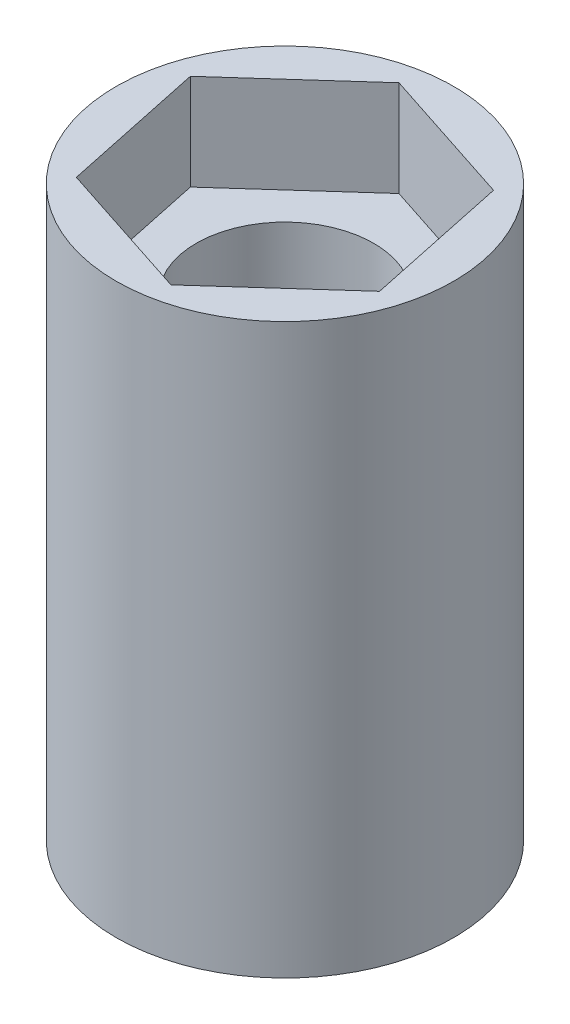
ISO-10303-21;
HEADER;
FILE_DESCRIPTION(('STEP AP214'),'2;1');
FILE_NAME('part.step','',(''),(''),'','','');
FILE_SCHEMA(('AUTOMOTIVE_DESIGN { 1 0 10303 214 1 1 1 1 }'));
ENDSEC;
DATA;
#1=APPLICATION_CONTEXT('core data for automotive mechanical design processes');
#2=APPLICATION_PROTOCOL_DEFINITION('international standard','automotive_design',2000,#1);
#3=PRODUCT_CONTEXT('',#1,'mechanical');
#4=PRODUCT('Part','Part','',(#3));
#5=PRODUCT_RELATED_PRODUCT_CATEGORY('part','',(#4));
#6=PRODUCT_DEFINITION_FORMATION('','',#4);
#7=PRODUCT_DEFINITION_CONTEXT('part definition',#1,'design');
#8=PRODUCT_DEFINITION('design','',#6,#7);
#9=PRODUCT_DEFINITION_SHAPE('','',#8);
#10=(LENGTH_UNIT() NAMED_UNIT(*) SI_UNIT(.MILLI.,.METRE.));
#11=(NAMED_UNIT(*) PLANE_ANGLE_UNIT() SI_UNIT($,.RADIAN.));
#12=(NAMED_UNIT(*) SI_UNIT($,.STERADIAN.) SOLID_ANGLE_UNIT());
#13=UNCERTAINTY_MEASURE_WITH_UNIT(LENGTH_MEASURE(1.E-05),#10,'distance_accuracy_value','');
#14=(GEOMETRIC_REPRESENTATION_CONTEXT(3) GLOBAL_UNCERTAINTY_ASSIGNED_CONTEXT((#13)) GLOBAL_UNIT_ASSIGNED_CONTEXT((#10,
#11,#12)) REPRESENTATION_CONTEXT('',''));
#15=CARTESIAN_POINT('',(0.,0.,0.));
#16=DIRECTION('',(0.,0.,1.));
#17=DIRECTION('',(1.,0.,0.));
#18=AXIS2_PLACEMENT_3D('',#15,#16,#17);
#19=CARTESIAN_POINT('',(0.,16.,0.));
#20=DIRECTION('',(0.,-1.,0.));
#21=DIRECTION('',(0.,0.,-1.));
#22=AXIS2_PLACEMENT_3D('',#19,#20,#21);
#23=CYLINDRICAL_SURFACE('',#22,2.5);
#24=CARTESIAN_POINT('',(0.,0.,0.));
#25=DIRECTION('',(0.,1.,0.));
#26=DIRECTION('',(0.,0.,1.));
#27=AXIS2_PLACEMENT_3D('',#24,#25,#26);
#28=CIRCLE('',#27,2.5);
#29=CARTESIAN_POINT('',(0.,0.,2.5));
#30=VERTEX_POINT('',#29);
#31=EDGE_CURVE('E142',#30,#30,#28,.T.);
#32=ORIENTED_EDGE('',*,*,#31,.F.);
#33=EDGE_LOOP('',(#32));
#34=FACE_BOUND('',#33,.T.);
#35=CARTESIAN_POINT('',(0.,13.3,0.));
#36=DIRECTION('',(0.,1.,0.));
#37=DIRECTION('',(0.,0.,1.));
#38=AXIS2_PLACEMENT_3D('',#35,#36,#37);
#39=CIRCLE('',#38,2.5);
#40=CARTESIAN_POINT('',(0.,13.3,2.5));
#41=VERTEX_POINT('',#40);
#42=EDGE_CURVE('E37',#41,#41,#39,.T.);
#43=ORIENTED_EDGE('',*,*,#42,.T.);
#44=EDGE_LOOP('',(#43));
#45=FACE_BOUND('',#44,.T.);
#46=ADVANCED_FACE('F33',(#34,#45),#23,.F.);
#47=CARTESIAN_POINT('',(0.,16.,0.));
#48=DIRECTION('',(0.,1.,0.));
#49=DIRECTION('',(0.,0.,1.));
#50=AXIS2_PLACEMENT_3D('',#47,#48,#49);
#51=PLANE('',#50);
#52=DIRECTION('',(-0.206603535414547,0.,-0.978424743735669));
#53=VECTOR('',#52,1.);
#54=CARTESIAN_POINT('',(3.95174646188203,16.,1.28984491354692));
#55=LINE('',#54,#53);
#56=CARTESIAN_POINT('',(3.95174646188203,16.,1.28984491354692));
#57=VERTEX_POINT('',#56);
#58=CARTESIAN_POINT('',(3.09291169301479,16.,-2.77739036853165));
#59=VERTEX_POINT('',#58);
#60=EDGE_CURVE('E50',#57,#59,#55,.T.);
#61=ORIENTED_EDGE('',*,*,#60,.F.);
#62=DIRECTION('',(0.744038916059095,0.,-0.66813628204851));
#63=VECTOR('',#62,1.);
#64=CARTESIAN_POINT('',(0.858834768867244,16.,4.06723528207857));
#65=LINE('',#64,#63);
#66=CARTESIAN_POINT('',(0.858834768867244,16.,4.06723528207857));
#67=VERTEX_POINT('',#66);
#68=EDGE_CURVE('E133',#67,#57,#65,.T.);
#69=ORIENTED_EDGE('',*,*,#68,.F.);
#70=DIRECTION('',(0.950642451473642,0.,0.310288461687159));
#71=VECTOR('',#70,1.);
#72=CARTESIAN_POINT('',(-3.09291169301478,16.,2.77739036853166));
#73=LINE('',#72,#71);
#74=CARTESIAN_POINT('',(-3.09291169301478,16.,2.77739036853166));
#75=VERTEX_POINT('',#74);
#76=EDGE_CURVE('E131',#75,#67,#73,.T.);
#77=ORIENTED_EDGE('',*,*,#76,.F.);
#78=DIRECTION('',(0.206603535414547,0.,0.978424743735669));
#79=VECTOR('',#78,1.);
#80=CARTESIAN_POINT('',(-3.95174646188203,16.,-1.28984491354692));
#81=LINE('',#80,#79);
#82=CARTESIAN_POINT('',(-3.95174646188203,16.,-1.28984491354692));
#83=VERTEX_POINT('',#82);
#84=EDGE_CURVE('E98',#83,#75,#81,.T.);
#85=ORIENTED_EDGE('',*,*,#84,.F.);
#86=DIRECTION('',(-0.744038916059095,0.,0.66813628204851));
#87=VECTOR('',#86,1.);
#88=CARTESIAN_POINT('',(-0.858834768867244,16.,-4.06723528207857));
#89=LINE('',#88,#87);
#90=CARTESIAN_POINT('',(-0.858834768867244,16.,-4.06723528207857));
#91=VERTEX_POINT('',#90);
#92=EDGE_CURVE('E127',#91,#83,#89,.T.);
#93=ORIENTED_EDGE('',*,*,#92,.F.);
#94=DIRECTION('',(-0.950642451473642,0.,-0.310288461687159));
#95=VECTOR('',#94,1.);
#96=CARTESIAN_POINT('',(3.09291169301479,16.,-2.77739036853165));
#97=LINE('',#96,#95);
#98=EDGE_CURVE('E124',#59,#91,#97,.T.);
#99=ORIENTED_EDGE('',*,*,#98,.F.);
#100=EDGE_LOOP('',(#61,#69,#77,#85,#93,#99));
#101=FACE_BOUND('',#100,.T.);
#102=CARTESIAN_POINT('',(0.,16.,0.));
#103=DIRECTION('',(0.,1.,0.));
#104=DIRECTION('',(0.,0.,1.));
#105=AXIS2_PLACEMENT_3D('',#102,#103,#104);
#106=CIRCLE('',#105,4.75);
#107=CARTESIAN_POINT('',(0.,16.,4.75));
#108=VERTEX_POINT('',#107);
#109=EDGE_CURVE('E11',#108,#108,#106,.T.);
#110=ORIENTED_EDGE('',*,*,#109,.T.);
#111=EDGE_LOOP('',(#110));
#112=FACE_BOUND('',#111,.T.);
#113=ADVANCED_FACE('F151',(#101,#112),#51,.T.);
#114=CARTESIAN_POINT('',(0.,0.,0.));
#115=DIRECTION('',(0.,1.,0.));
#116=DIRECTION('',(0.,0.,1.));
#117=AXIS2_PLACEMENT_3D('',#114,#115,#116);
#118=PLANE('',#117);
#119=CARTESIAN_POINT('',(0.,0.,0.));
#120=DIRECTION('',(0.,1.,0.));
#121=DIRECTION('',(0.,0.,1.));
#122=AXIS2_PLACEMENT_3D('',#119,#120,#121);
#123=CIRCLE('',#122,4.75);
#124=CARTESIAN_POINT('',(0.,0.,4.75));
#125=VERTEX_POINT('',#124);
#126=EDGE_CURVE('E42',#125,#125,#123,.T.);
#127=ORIENTED_EDGE('',*,*,#126,.F.);
#128=EDGE_LOOP('',(#127));
#129=FACE_BOUND('',#128,.T.);
#130=ORIENTED_EDGE('',*,*,#31,.T.);
#131=EDGE_LOOP('',(#130));
#132=FACE_BOUND('',#131,.T.);
#133=ADVANCED_FACE('F148',(#129,#132),#118,.F.);
#134=CARTESIAN_POINT('',(0.,16.,0.));
#135=DIRECTION('',(0.,-1.,0.));
#136=DIRECTION('',(0.,0.,-1.));
#137=AXIS2_PLACEMENT_3D('',#134,#135,#136);
#138=CYLINDRICAL_SURFACE('',#137,4.75);
#139=ORIENTED_EDGE('',*,*,#109,.F.);
#140=EDGE_LOOP('',(#139));
#141=FACE_BOUND('',#140,.T.);
#142=ORIENTED_EDGE('',*,*,#126,.T.);
#143=EDGE_LOOP('',(#142));
#144=FACE_BOUND('',#143,.T.);
#145=ADVANCED_FACE('F35',(#141,#144),#138,.T.);
#146=CARTESIAN_POINT('',(3.95174646188203,13.3,1.28984491354692));
#147=DIRECTION('',(0.978424743735669,0.,-0.206603535414547));
#148=DIRECTION('',(-0.206603535414547,0.,-0.978424743735669));
#149=AXIS2_PLACEMENT_3D('',#146,#147,#148);
#150=PLANE('',#149);
#151=ORIENTED_EDGE('',*,*,#60,.T.);
#152=DIRECTION('',(0.,1.,0.));
#153=VECTOR('',#152,1.);
#154=CARTESIAN_POINT('',(3.09291169301479,13.3,-2.77739036853165));
#155=LINE('',#154,#153);
#156=CARTESIAN_POINT('',(3.09291169301479,13.3,-2.77739036853165));
#157=VERTEX_POINT('',#156);
#158=EDGE_CURVE('E80',#157,#59,#155,.T.);
#159=ORIENTED_EDGE('',*,*,#158,.F.);
#160=DIRECTION('',(-0.206603535414547,0.,-0.978424743735669));
#161=VECTOR('',#160,1.);
#162=CARTESIAN_POINT('',(3.95174646188203,13.3,1.28984491354692));
#163=LINE('',#162,#161);
#164=CARTESIAN_POINT('',(3.95174646188203,13.3,1.28984491354692));
#165=VERTEX_POINT('',#164);
#166=EDGE_CURVE('E135',#165,#157,#163,.T.);
#167=ORIENTED_EDGE('',*,*,#166,.F.);
#168=DIRECTION('',(0.,1.,0.));
#169=VECTOR('',#168,1.);
#170=CARTESIAN_POINT('',(3.95174646188203,13.3,1.28984491354692));
#171=LINE('',#170,#169);
#172=EDGE_CURVE('E58',#165,#57,#171,.T.);
#173=ORIENTED_EDGE('',*,*,#172,.T.);
#174=EDGE_LOOP('',(#151,#159,#167,#173));
#175=FACE_BOUND('',#174,.T.);
#176=ADVANCED_FACE('F173',(#175),#150,.F.);
#177=CARTESIAN_POINT('',(0.858834768867244,13.3,4.06723528207857));
#178=DIRECTION('',(0.66813628204851,0.,0.744038916059095));
#179=DIRECTION('',(0.744038916059095,0.,-0.66813628204851));
#180=AXIS2_PLACEMENT_3D('',#177,#178,#179);
#181=PLANE('',#180);
#182=ORIENTED_EDGE('',*,*,#68,.T.);
#183=ORIENTED_EDGE('',*,*,#172,.F.);
#184=DIRECTION('',(0.744038916059095,0.,-0.66813628204851));
#185=VECTOR('',#184,1.);
#186=CARTESIAN_POINT('',(0.858834768867244,13.3,4.06723528207857));
#187=LINE('',#186,#185);
#188=CARTESIAN_POINT('',(0.858834768867244,13.3,4.06723528207857));
#189=VERTEX_POINT('',#188);
#190=EDGE_CURVE('E110',#189,#165,#187,.T.);
#191=ORIENTED_EDGE('',*,*,#190,.F.);
#192=DIRECTION('',(0.,1.,0.));
#193=VECTOR('',#192,1.);
#194=CARTESIAN_POINT('',(0.858834768867244,13.3,4.06723528207857));
#195=LINE('',#194,#193);
#196=EDGE_CURVE('E102',#189,#67,#195,.T.);
#197=ORIENTED_EDGE('',*,*,#196,.T.);
#198=EDGE_LOOP('',(#182,#183,#191,#197));
#199=FACE_BOUND('',#198,.T.);
#200=ADVANCED_FACE('F170',(#199),#181,.F.);
#201=CARTESIAN_POINT('',(-3.09291169301478,13.3,2.77739036853166));
#202=DIRECTION('',(-0.310288461687159,0.,0.950642451473642));
#203=DIRECTION('',(0.950642451473643,0.,0.310288461687159));
#204=AXIS2_PLACEMENT_3D('',#201,#202,#203);
#205=PLANE('',#204);
#206=ORIENTED_EDGE('',*,*,#76,.T.);
#207=ORIENTED_EDGE('',*,*,#196,.F.);
#208=DIRECTION('',(0.950642451473642,0.,0.310288461687159));
#209=VECTOR('',#208,1.);
#210=CARTESIAN_POINT('',(-3.09291169301478,13.3,2.77739036853166));
#211=LINE('',#210,#209);
#212=CARTESIAN_POINT('',(-3.09291169301478,13.3,2.77739036853166));
#213=VERTEX_POINT('',#212);
#214=EDGE_CURVE('E106',#213,#189,#211,.T.);
#215=ORIENTED_EDGE('',*,*,#214,.F.);
#216=DIRECTION('',(0.,1.,0.));
#217=VECTOR('',#216,1.);
#218=CARTESIAN_POINT('',(-3.09291169301478,13.3,2.77739036853166));
#219=LINE('',#218,#217);
#220=EDGE_CURVE('E91',#213,#75,#219,.T.);
#221=ORIENTED_EDGE('',*,*,#220,.T.);
#222=EDGE_LOOP('',(#206,#207,#215,#221));
#223=FACE_BOUND('',#222,.T.);
#224=ADVANCED_FACE('F107',(#223),#205,.F.);
#225=CARTESIAN_POINT('',(-3.95174646188203,13.3,-1.28984491354692));
#226=DIRECTION('',(-0.978424743735669,0.,0.206603535414547));
#227=DIRECTION('',(0.206603535414547,0.,0.978424743735669));
#228=AXIS2_PLACEMENT_3D('',#225,#226,#227);
#229=PLANE('',#228);
#230=ORIENTED_EDGE('',*,*,#84,.T.);
#231=ORIENTED_EDGE('',*,*,#220,.F.);
#232=DIRECTION('',(0.206603535414547,0.,0.978424743735669));
#233=VECTOR('',#232,1.);
#234=CARTESIAN_POINT('',(-3.95174646188203,13.3,-1.28984491354692));
#235=LINE('',#234,#233);
#236=CARTESIAN_POINT('',(-3.95174646188203,13.3,-1.28984491354692));
#237=VERTEX_POINT('',#236);
#238=EDGE_CURVE('E95',#237,#213,#235,.T.);
#239=ORIENTED_EDGE('',*,*,#238,.F.);
#240=DIRECTION('',(0.,1.,0.));
#241=VECTOR('',#240,1.);
#242=CARTESIAN_POINT('',(-3.95174646188203,13.3,-1.28984491354692));
#243=LINE('',#242,#241);
#244=EDGE_CURVE('E103',#237,#83,#243,.T.);
#245=ORIENTED_EDGE('',*,*,#244,.T.);
#246=EDGE_LOOP('',(#230,#231,#239,#245));
#247=FACE_BOUND('',#246,.T.);
#248=ADVANCED_FACE('F93',(#247),#229,.F.);
#249=CARTESIAN_POINT('',(-0.858834768867244,13.3,-4.06723528207857));
#250=DIRECTION('',(-0.66813628204851,0.,-0.744038916059095));
#251=DIRECTION('',(-0.744038916059095,0.,0.66813628204851));
#252=AXIS2_PLACEMENT_3D('',#249,#250,#251);
#253=PLANE('',#252);
#254=ORIENTED_EDGE('',*,*,#92,.T.);
#255=ORIENTED_EDGE('',*,*,#244,.F.);
#256=DIRECTION('',(-0.744038916059095,0.,0.66813628204851));
#257=VECTOR('',#256,1.);
#258=CARTESIAN_POINT('',(-0.858834768867244,13.3,-4.06723528207857));
#259=LINE('',#258,#257);
#260=CARTESIAN_POINT('',(-0.858834768867244,13.3,-4.06723528207857));
#261=VERTEX_POINT('',#260);
#262=EDGE_CURVE('E116',#261,#237,#259,.T.);
#263=ORIENTED_EDGE('',*,*,#262,.F.);
#264=DIRECTION('',(0.,1.,0.));
#265=VECTOR('',#264,1.);
#266=CARTESIAN_POINT('',(-0.858834768867244,13.3,-4.06723528207857));
#267=LINE('',#266,#265);
#268=EDGE_CURVE('E139',#261,#91,#267,.T.);
#269=ORIENTED_EDGE('',*,*,#268,.T.);
#270=EDGE_LOOP('',(#254,#255,#263,#269));
#271=FACE_BOUND('',#270,.T.);
#272=ADVANCED_FACE('F166',(#271),#253,.F.);
#273=CARTESIAN_POINT('',(3.09291169301479,13.3,-2.77739036853165));
#274=DIRECTION('',(0.310288461687159,0.,-0.950642451473642));
#275=DIRECTION('',(-0.950642451473642,0.,-0.310288461687159));
#276=AXIS2_PLACEMENT_3D('',#273,#274,#275);
#277=PLANE('',#276);
#278=ORIENTED_EDGE('',*,*,#98,.T.);
#279=ORIENTED_EDGE('',*,*,#268,.F.);
#280=DIRECTION('',(-0.950642451473642,0.,-0.310288461687159));
#281=VECTOR('',#280,1.);
#282=CARTESIAN_POINT('',(3.09291169301479,13.3,-2.77739036853165));
#283=LINE('',#282,#281);
#284=EDGE_CURVE('E118',#157,#261,#283,.T.);
#285=ORIENTED_EDGE('',*,*,#284,.F.);
#286=ORIENTED_EDGE('',*,*,#158,.T.);
#287=EDGE_LOOP('',(#278,#279,#285,#286));
#288=FACE_BOUND('',#287,.T.);
#289=ADVANCED_FACE('F161',(#288),#277,.F.);
#290=CARTESIAN_POINT('',(0.,13.3,0.));
#291=DIRECTION('',(0.,1.,0.));
#292=DIRECTION('',(0.,0.,1.));
#293=AXIS2_PLACEMENT_3D('',#290,#291,#292);
#294=PLANE('',#293);
#295=ORIENTED_EDGE('',*,*,#42,.F.);
#296=EDGE_LOOP('',(#295));
#297=FACE_BOUND('',#296,.T.);
#298=ORIENTED_EDGE('',*,*,#166,.T.);
#299=ORIENTED_EDGE('',*,*,#284,.T.);
#300=ORIENTED_EDGE('',*,*,#262,.T.);
#301=ORIENTED_EDGE('',*,*,#238,.T.);
#302=ORIENTED_EDGE('',*,*,#214,.T.);
#303=ORIENTED_EDGE('',*,*,#190,.T.);
#304=EDGE_LOOP('',(#298,#299,#300,#301,#302,#303));
#305=FACE_BOUND('',#304,.T.);
#306=ADVANCED_FACE('F113',(#297,#305),#294,.T.);
#307=CLOSED_SHELL('',(#46,#113,#133,#145,#176,#200,#224,#248,#272,#289,#306));
#308=MANIFOLD_SOLID_BREP('B2',#307);
#309=ADVANCED_BREP_SHAPE_REPRESENTATION('',(#18,#308),#14);
#310=SHAPE_DEFINITION_REPRESENTATION(#9,#309);
ENDSEC;
END-ISO-10303-21;
